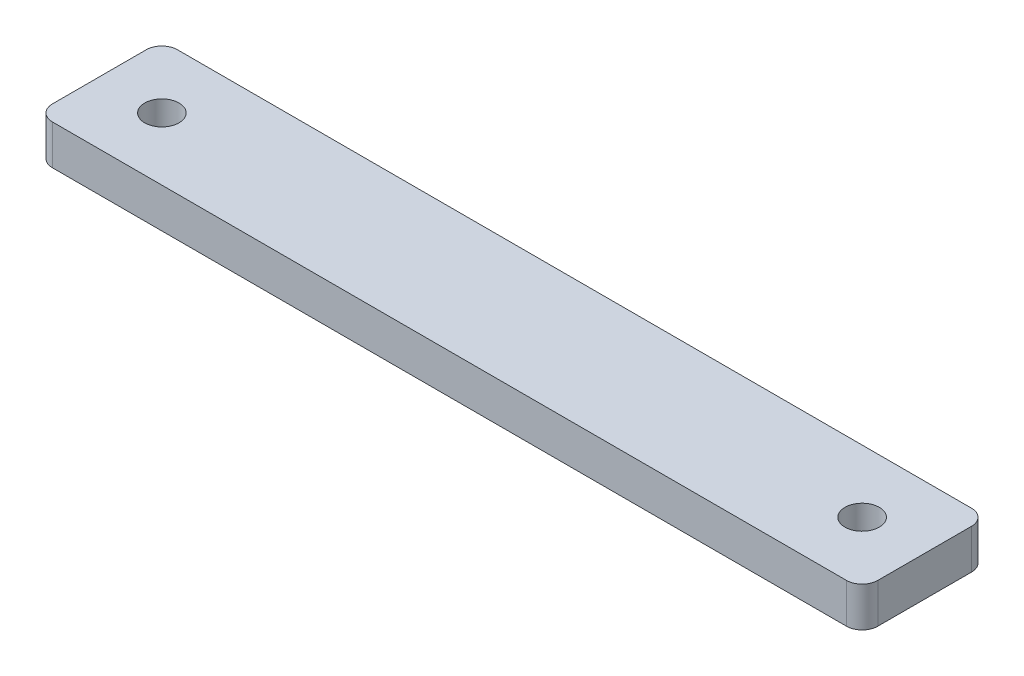
ISO-10303-21;
HEADER;
FILE_DESCRIPTION(('STEP AP214'),'2;1');
FILE_NAME('part.step','',(''),(''),'','','');
FILE_SCHEMA(('AUTOMOTIVE_DESIGN { 1 0 10303 214 1 1 1 1 }'));
ENDSEC;
DATA;
#1=APPLICATION_CONTEXT('core data for automotive mechanical design processes');
#2=APPLICATION_PROTOCOL_DEFINITION('international standard','automotive_design',2000,#1);
#3=PRODUCT_CONTEXT('',#1,'mechanical');
#4=PRODUCT('Part','Part','',(#3));
#5=PRODUCT_RELATED_PRODUCT_CATEGORY('part','',(#4));
#6=PRODUCT_DEFINITION_FORMATION('','',#4);
#7=PRODUCT_DEFINITION_CONTEXT('part definition',#1,'design');
#8=PRODUCT_DEFINITION('design','',#6,#7);
#9=PRODUCT_DEFINITION_SHAPE('','',#8);
#10=(LENGTH_UNIT() NAMED_UNIT(*) SI_UNIT(.MILLI.,.METRE.));
#11=(NAMED_UNIT(*) PLANE_ANGLE_UNIT() SI_UNIT($,.RADIAN.));
#12=(NAMED_UNIT(*) SI_UNIT($,.STERADIAN.) SOLID_ANGLE_UNIT());
#13=UNCERTAINTY_MEASURE_WITH_UNIT(LENGTH_MEASURE(1.E-05),#10,'distance_accuracy_value','');
#14=(GEOMETRIC_REPRESENTATION_CONTEXT(3) GLOBAL_UNCERTAINTY_ASSIGNED_CONTEXT((#13)) GLOBAL_UNIT_ASSIGNED_CONTEXT((#10,
#11,#12)) REPRESENTATION_CONTEXT('',''));
#15=CARTESIAN_POINT('',(0.,0.,0.));
#16=DIRECTION('',(0.,0.,1.));
#17=DIRECTION('',(1.,0.,0.));
#18=AXIS2_PLACEMENT_3D('',#15,#16,#17);
#19=CARTESIAN_POINT('',(0.,6.35,0.));
#20=DIRECTION('',(0.,1.,0.));
#21=DIRECTION('',(0.,0.,1.));
#22=AXIS2_PLACEMENT_3D('',#19,#20,#21);
#23=PLANE('',#22);
#24=CARTESIAN_POINT('',(-56.,6.35,0.));
#25=DIRECTION('',(0.,1.,0.));
#26=DIRECTION('',(0.,0.,1.));
#27=AXIS2_PLACEMENT_3D('',#24,#25,#26);
#28=CIRCLE('',#27,2.75);
#29=CARTESIAN_POINT('',(-56.,6.35,2.75));
#30=VERTEX_POINT('',#29);
#31=EDGE_CURVE('E192',#30,#30,#28,.T.);
#32=ORIENTED_EDGE('',*,*,#31,.F.);
#33=EDGE_LOOP('',(#32));
#34=FACE_BOUND('',#33,.T.);
#35=DIRECTION('',(0.,0.,-1.));
#36=VECTOR('',#35,1.);
#37=CARTESIAN_POINT('',(66.,6.35,9.99999999999999));
#38=LINE('',#37,#36);
#39=CARTESIAN_POINT('',(66.,6.35,7.49999999999999));
#40=VERTEX_POINT('',#39);
#41=CARTESIAN_POINT('',(66.,6.35,-7.50000000000001));
#42=VERTEX_POINT('',#41);
#43=EDGE_CURVE('E202',#40,#42,#38,.T.);
#44=ORIENTED_EDGE('',*,*,#43,.T.);
#45=CARTESIAN_POINT('',(63.5,6.35,-7.50000000000001));
#46=DIRECTION('',(0.,1.,0.));
#47=DIRECTION('',(0.,0.,1.));
#48=AXIS2_PLACEMENT_3D('',#45,#46,#47);
#49=CIRCLE('',#48,2.5);
#50=CARTESIAN_POINT('',(63.5,6.35,-10.));
#51=VERTEX_POINT('',#50);
#52=EDGE_CURVE('E171',#42,#51,#49,.T.);
#53=ORIENTED_EDGE('',*,*,#52,.T.);
#54=DIRECTION('',(-1.,0.,0.));
#55=VECTOR('',#54,1.);
#56=CARTESIAN_POINT('',(66.,6.35,-10.));
#57=LINE('',#56,#55);
#58=CARTESIAN_POINT('',(-63.5,6.35,-9.99999999999999));
#59=VERTEX_POINT('',#58);
#60=EDGE_CURVE('E129',#51,#59,#57,.T.);
#61=ORIENTED_EDGE('',*,*,#60,.T.);
#62=CARTESIAN_POINT('',(-63.5,6.35,-7.5));
#63=DIRECTION('',(0.,1.,0.));
#64=DIRECTION('',(0.,0.,1.));
#65=AXIS2_PLACEMENT_3D('',#62,#63,#64);
#66=CIRCLE('',#65,2.5);
#67=CARTESIAN_POINT('',(-66.,6.35,-7.5));
#68=VERTEX_POINT('',#67);
#69=EDGE_CURVE('E163',#59,#68,#66,.T.);
#70=ORIENTED_EDGE('',*,*,#69,.T.);
#71=DIRECTION('',(0.,0.,1.));
#72=VECTOR('',#71,1.);
#73=CARTESIAN_POINT('',(-66.,6.35,10.));
#74=LINE('',#73,#72);
#75=CARTESIAN_POINT('',(-66.,6.35,7.50000000000001));
#76=VERTEX_POINT('',#75);
#77=EDGE_CURVE('E138',#68,#76,#74,.T.);
#78=ORIENTED_EDGE('',*,*,#77,.T.);
#79=CARTESIAN_POINT('',(-63.5,6.35,7.50000000000001));
#80=DIRECTION('',(0.,1.,0.));
#81=DIRECTION('',(0.,0.,1.));
#82=AXIS2_PLACEMENT_3D('',#79,#80,#81);
#83=CIRCLE('',#82,2.5);
#84=CARTESIAN_POINT('',(-63.5,6.35,10.));
#85=VERTEX_POINT('',#84);
#86=EDGE_CURVE('E64',#76,#85,#83,.T.);
#87=ORIENTED_EDGE('',*,*,#86,.T.);
#88=DIRECTION('',(1.,0.,0.));
#89=VECTOR('',#88,1.);
#90=CARTESIAN_POINT('',(66.,6.35,9.99999999999999));
#91=LINE('',#90,#89);
#92=CARTESIAN_POINT('',(63.5,6.35,9.99999999999999));
#93=VERTEX_POINT('',#92);
#94=EDGE_CURVE('E143',#85,#93,#91,.T.);
#95=ORIENTED_EDGE('',*,*,#94,.T.);
#96=CARTESIAN_POINT('',(63.5,6.35,7.49999999999999));
#97=DIRECTION('',(0.,1.,0.));
#98=DIRECTION('',(0.,0.,1.));
#99=AXIS2_PLACEMENT_3D('',#96,#97,#98);
#100=CIRCLE('',#99,2.5);
#101=EDGE_CURVE('E168',#93,#40,#100,.T.);
#102=ORIENTED_EDGE('',*,*,#101,.T.);
#103=EDGE_LOOP('',(#44,#53,#61,#70,#78,#87,#95,#102));
#104=FACE_BOUND('',#103,.T.);
#105=CARTESIAN_POINT('',(56.,6.35,0.));
#106=DIRECTION('',(0.,1.,0.));
#107=DIRECTION('',(0.,0.,1.));
#108=AXIS2_PLACEMENT_3D('',#105,#106,#107);
#109=CIRCLE('',#108,2.75);
#110=CARTESIAN_POINT('',(56.,6.35,2.75));
#111=VERTEX_POINT('',#110);
#112=EDGE_CURVE('E210',#111,#111,#109,.T.);
#113=ORIENTED_EDGE('',*,*,#112,.F.);
#114=EDGE_LOOP('',(#113));
#115=FACE_BOUND('',#114,.T.);
#116=ADVANCED_FACE('F41',(#34,#104,#115),#23,.T.);
#117=CARTESIAN_POINT('',(0.,0.,0.));
#118=DIRECTION('',(0.,1.,0.));
#119=DIRECTION('',(0.,0.,1.));
#120=AXIS2_PLACEMENT_3D('',#117,#118,#119);
#121=PLANE('',#120);
#122=DIRECTION('',(-1.,0.,0.));
#123=VECTOR('',#122,1.);
#124=CARTESIAN_POINT('',(66.,0.,-10.));
#125=LINE('',#124,#123);
#126=CARTESIAN_POINT('',(63.5,0.,-10.));
#127=VERTEX_POINT('',#126);
#128=CARTESIAN_POINT('',(-63.5,0.,-9.99999999999999));
#129=VERTEX_POINT('',#128);
#130=EDGE_CURVE('E126',#127,#129,#125,.T.);
#131=ORIENTED_EDGE('',*,*,#130,.F.);
#132=CARTESIAN_POINT('',(63.5,0.,-7.50000000000001));
#133=DIRECTION('',(0.,1.,0.));
#134=DIRECTION('',(0.,0.,1.));
#135=AXIS2_PLACEMENT_3D('',#132,#133,#134);
#136=CIRCLE('',#135,2.5);
#137=CARTESIAN_POINT('',(66.,0.,-7.50000000000001));
#138=VERTEX_POINT('',#137);
#139=EDGE_CURVE('E108',#127,#138,#136,.F.);
#140=ORIENTED_EDGE('',*,*,#139,.T.);
#141=DIRECTION('',(0.,0.,-1.));
#142=VECTOR('',#141,1.);
#143=CARTESIAN_POINT('',(66.,0.,9.99999999999999));
#144=LINE('',#143,#142);
#145=CARTESIAN_POINT('',(66.,0.,7.49999999999999));
#146=VERTEX_POINT('',#145);
#147=EDGE_CURVE('E139',#146,#138,#144,.T.);
#148=ORIENTED_EDGE('',*,*,#147,.F.);
#149=CARTESIAN_POINT('',(63.5,0.,7.49999999999999));
#150=DIRECTION('',(0.,1.,0.));
#151=DIRECTION('',(0.,0.,1.));
#152=AXIS2_PLACEMENT_3D('',#149,#150,#151);
#153=CIRCLE('',#152,2.5);
#154=CARTESIAN_POINT('',(63.5,0.,9.99999999999999));
#155=VERTEX_POINT('',#154);
#156=EDGE_CURVE('E120',#146,#155,#153,.F.);
#157=ORIENTED_EDGE('',*,*,#156,.T.);
#158=DIRECTION('',(1.,0.,0.));
#159=VECTOR('',#158,1.);
#160=CARTESIAN_POINT('',(66.,0.,9.99999999999999));
#161=LINE('',#160,#159);
#162=CARTESIAN_POINT('',(-63.5,0.,10.));
#163=VERTEX_POINT('',#162);
#164=EDGE_CURVE('E145',#163,#155,#161,.T.);
#165=ORIENTED_EDGE('',*,*,#164,.F.);
#166=CARTESIAN_POINT('',(-63.5,0.,7.50000000000001));
#167=DIRECTION('',(0.,1.,0.));
#168=DIRECTION('',(0.,0.,1.));
#169=AXIS2_PLACEMENT_3D('',#166,#167,#168);
#170=CIRCLE('',#169,2.5);
#171=CARTESIAN_POINT('',(-66.,0.,7.50000000000001));
#172=VERTEX_POINT('',#171);
#173=EDGE_CURVE('E153',#163,#172,#170,.F.);
#174=ORIENTED_EDGE('',*,*,#173,.T.);
#175=DIRECTION('',(0.,0.,1.));
#176=VECTOR('',#175,1.);
#177=CARTESIAN_POINT('',(-66.,0.,10.));
#178=LINE('',#177,#176);
#179=CARTESIAN_POINT('',(-66.,0.,-7.5));
#180=VERTEX_POINT('',#179);
#181=EDGE_CURVE('E186',#180,#172,#178,.T.);
#182=ORIENTED_EDGE('',*,*,#181,.F.);
#183=CARTESIAN_POINT('',(-63.5,0.,-7.5));
#184=DIRECTION('',(0.,1.,0.));
#185=DIRECTION('',(0.,0.,1.));
#186=AXIS2_PLACEMENT_3D('',#183,#184,#185);
#187=CIRCLE('',#186,2.5);
#188=EDGE_CURVE('E131',#180,#129,#187,.F.);
#189=ORIENTED_EDGE('',*,*,#188,.T.);
#190=EDGE_LOOP('',(#131,#140,#148,#157,#165,#174,#182,#189));
#191=FACE_BOUND('',#190,.T.);
#192=CARTESIAN_POINT('',(-56.,0.,0.));
#193=DIRECTION('',(0.,1.,0.));
#194=DIRECTION('',(0.,0.,1.));
#195=AXIS2_PLACEMENT_3D('',#192,#193,#194);
#196=CIRCLE('',#195,2.75);
#197=CARTESIAN_POINT('',(-56.,0.,2.75));
#198=VERTEX_POINT('',#197);
#199=EDGE_CURVE('E197',#198,#198,#196,.T.);
#200=ORIENTED_EDGE('',*,*,#199,.T.);
#201=EDGE_LOOP('',(#200));
#202=FACE_BOUND('',#201,.T.);
#203=CARTESIAN_POINT('',(56.,0.,0.));
#204=DIRECTION('',(0.,1.,0.));
#205=DIRECTION('',(0.,0.,1.));
#206=AXIS2_PLACEMENT_3D('',#203,#204,#205);
#207=CIRCLE('',#206,2.75);
#208=CARTESIAN_POINT('',(56.,0.,2.75));
#209=VERTEX_POINT('',#208);
#210=EDGE_CURVE('E212',#209,#209,#207,.T.);
#211=ORIENTED_EDGE('',*,*,#210,.T.);
#212=EDGE_LOOP('',(#211));
#213=FACE_BOUND('',#212,.T.);
#214=ADVANCED_FACE('F134',(#191,#202,#213),#121,.F.);
#215=CARTESIAN_POINT('',(-66.,6.35,10.));
#216=DIRECTION('',(1.,0.,0.));
#217=DIRECTION('',(0.,0.,-1.));
#218=AXIS2_PLACEMENT_3D('',#215,#216,#217);
#219=PLANE('',#218);
#220=ORIENTED_EDGE('',*,*,#181,.T.);
#221=DIRECTION('',(0.,-1.,0.));
#222=VECTOR('',#221,1.);
#223=CARTESIAN_POINT('',(-66.,6.35,7.50000000000001));
#224=LINE('',#223,#222);
#225=EDGE_CURVE('E11',#172,#76,#224,.F.);
#226=ORIENTED_EDGE('',*,*,#225,.T.);
#227=ORIENTED_EDGE('',*,*,#77,.F.);
#228=DIRECTION('',(0.,-1.,0.));
#229=VECTOR('',#228,1.);
#230=CARTESIAN_POINT('',(-66.,6.35,-7.5));
#231=LINE('',#230,#229);
#232=EDGE_CURVE('E50',#68,#180,#231,.T.);
#233=ORIENTED_EDGE('',*,*,#232,.T.);
#234=EDGE_LOOP('',(#220,#226,#227,#233));
#235=FACE_BOUND('',#234,.T.);
#236=ADVANCED_FACE('F185',(#235),#219,.F.);
#237=CARTESIAN_POINT('',(66.,6.35,9.99999999999999));
#238=DIRECTION('',(0.,0.,-1.));
#239=DIRECTION('',(-1.,0.,0.));
#240=AXIS2_PLACEMENT_3D('',#237,#238,#239);
#241=PLANE('',#240);
#242=ORIENTED_EDGE('',*,*,#164,.T.);
#243=DIRECTION('',(0.,-1.,0.));
#244=VECTOR('',#243,1.);
#245=CARTESIAN_POINT('',(63.5,6.35,9.99999999999999));
#246=LINE('',#245,#244);
#247=EDGE_CURVE('E57',#155,#93,#246,.F.);
#248=ORIENTED_EDGE('',*,*,#247,.T.);
#249=ORIENTED_EDGE('',*,*,#94,.F.);
#250=DIRECTION('',(0.,-1.,0.));
#251=VECTOR('',#250,1.);
#252=CARTESIAN_POINT('',(-63.5,6.35,10.));
#253=LINE('',#252,#251);
#254=EDGE_CURVE('E174',#85,#163,#253,.T.);
#255=ORIENTED_EDGE('',*,*,#254,.T.);
#256=EDGE_LOOP('',(#242,#248,#249,#255));
#257=FACE_BOUND('',#256,.T.);
#258=ADVANCED_FACE('F240',(#257),#241,.F.);
#259=CARTESIAN_POINT('',(66.,6.35,9.99999999999999));
#260=DIRECTION('',(-1.,0.,0.));
#261=DIRECTION('',(0.,0.,1.));
#262=AXIS2_PLACEMENT_3D('',#259,#260,#261);
#263=PLANE('',#262);
#264=ORIENTED_EDGE('',*,*,#147,.T.);
#265=DIRECTION('',(0.,-1.,0.));
#266=VECTOR('',#265,1.);
#267=CARTESIAN_POINT('',(66.,6.35,-7.50000000000001));
#268=LINE('',#267,#266);
#269=EDGE_CURVE('E113',#138,#42,#268,.F.);
#270=ORIENTED_EDGE('',*,*,#269,.T.);
#271=ORIENTED_EDGE('',*,*,#43,.F.);
#272=DIRECTION('',(0.,-1.,0.));
#273=VECTOR('',#272,1.);
#274=CARTESIAN_POINT('',(66.,6.35,7.49999999999999));
#275=LINE('',#274,#273);
#276=EDGE_CURVE('E119',#40,#146,#275,.T.);
#277=ORIENTED_EDGE('',*,*,#276,.T.);
#278=EDGE_LOOP('',(#264,#270,#271,#277));
#279=FACE_BOUND('',#278,.T.);
#280=ADVANCED_FACE('F237',(#279),#263,.F.);
#281=CARTESIAN_POINT('',(66.,6.35,-10.));
#282=DIRECTION('',(0.,0.,1.));
#283=DIRECTION('',(1.,0.,0.));
#284=AXIS2_PLACEMENT_3D('',#281,#282,#283);
#285=PLANE('',#284);
#286=ORIENTED_EDGE('',*,*,#60,.F.);
#287=DIRECTION('',(0.,-1.,0.));
#288=VECTOR('',#287,1.);
#289=CARTESIAN_POINT('',(63.5,6.35,-10.));
#290=LINE('',#289,#288);
#291=EDGE_CURVE('E112',#51,#127,#290,.T.);
#292=ORIENTED_EDGE('',*,*,#291,.T.);
#293=ORIENTED_EDGE('',*,*,#130,.T.);
#294=DIRECTION('',(0.,-1.,0.));
#295=VECTOR('',#294,1.);
#296=CARTESIAN_POINT('',(-63.5,6.35,-9.99999999999999));
#297=LINE('',#296,#295);
#298=EDGE_CURVE('E132',#129,#59,#297,.F.);
#299=ORIENTED_EDGE('',*,*,#298,.T.);
#300=EDGE_LOOP('',(#286,#292,#293,#299));
#301=FACE_BOUND('',#300,.T.);
#302=ADVANCED_FACE('F125',(#301),#285,.F.);
#303=CARTESIAN_POINT('',(-56.,6.35,0.));
#304=DIRECTION('',(0.,-1.,0.));
#305=DIRECTION('',(0.,0.,-1.));
#306=AXIS2_PLACEMENT_3D('',#303,#304,#305);
#307=CYLINDRICAL_SURFACE('',#306,2.75);
#308=ORIENTED_EDGE('',*,*,#31,.T.);
#309=EDGE_LOOP('',(#308));
#310=FACE_BOUND('',#309,.T.);
#311=ORIENTED_EDGE('',*,*,#199,.F.);
#312=EDGE_LOOP('',(#311));
#313=FACE_BOUND('',#312,.T.);
#314=ADVANCED_FACE('F232',(#310,#313),#307,.F.);
#315=CARTESIAN_POINT('',(56.,6.35,0.));
#316=DIRECTION('',(0.,-1.,0.));
#317=DIRECTION('',(0.,0.,-1.));
#318=AXIS2_PLACEMENT_3D('',#315,#316,#317);
#319=CYLINDRICAL_SURFACE('',#318,2.75);
#320=ORIENTED_EDGE('',*,*,#112,.T.);
#321=EDGE_LOOP('',(#320));
#322=FACE_BOUND('',#321,.T.);
#323=ORIENTED_EDGE('',*,*,#210,.F.);
#324=EDGE_LOOP('',(#323));
#325=FACE_BOUND('',#324,.T.);
#326=ADVANCED_FACE('F220',(#322,#325),#319,.F.);
#327=CARTESIAN_POINT('',(63.5,6.35,-7.50000000000001));
#328=DIRECTION('',(0.,-1.,0.));
#329=DIRECTION('',(0.,0.,-1.));
#330=AXIS2_PLACEMENT_3D('',#327,#328,#329);
#331=CYLINDRICAL_SURFACE('',#330,2.5);
#332=ORIENTED_EDGE('',*,*,#52,.F.);
#333=ORIENTED_EDGE('',*,*,#269,.F.);
#334=ORIENTED_EDGE('',*,*,#139,.F.);
#335=ORIENTED_EDGE('',*,*,#291,.F.);
#336=EDGE_LOOP('',(#332,#333,#334,#335));
#337=FACE_BOUND('',#336,.T.);
#338=ADVANCED_FACE('F111',(#337),#331,.T.);
#339=CARTESIAN_POINT('',(63.5,6.35,7.49999999999999));
#340=DIRECTION('',(0.,-1.,0.));
#341=DIRECTION('',(0.,0.,-1.));
#342=AXIS2_PLACEMENT_3D('',#339,#340,#341);
#343=CYLINDRICAL_SURFACE('',#342,2.5);
#344=ORIENTED_EDGE('',*,*,#101,.F.);
#345=ORIENTED_EDGE('',*,*,#247,.F.);
#346=ORIENTED_EDGE('',*,*,#156,.F.);
#347=ORIENTED_EDGE('',*,*,#276,.F.);
#348=EDGE_LOOP('',(#344,#345,#346,#347));
#349=FACE_BOUND('',#348,.T.);
#350=ADVANCED_FACE('F248',(#349),#343,.T.);
#351=CARTESIAN_POINT('',(-63.5,6.35,7.50000000000001));
#352=DIRECTION('',(0.,-1.,0.));
#353=DIRECTION('',(0.,0.,-1.));
#354=AXIS2_PLACEMENT_3D('',#351,#352,#353);
#355=CYLINDRICAL_SURFACE('',#354,2.5);
#356=ORIENTED_EDGE('',*,*,#86,.F.);
#357=ORIENTED_EDGE('',*,*,#225,.F.);
#358=ORIENTED_EDGE('',*,*,#173,.F.);
#359=ORIENTED_EDGE('',*,*,#254,.F.);
#360=EDGE_LOOP('',(#356,#357,#358,#359));
#361=FACE_BOUND('',#360,.T.);
#362=ADVANCED_FACE('F250',(#361),#355,.T.);
#363=CARTESIAN_POINT('',(-63.5,6.35,-7.5));
#364=DIRECTION('',(0.,-1.,0.));
#365=DIRECTION('',(0.,0.,-1.));
#366=AXIS2_PLACEMENT_3D('',#363,#364,#365);
#367=CYLINDRICAL_SURFACE('',#366,2.5);
#368=ORIENTED_EDGE('',*,*,#69,.F.);
#369=ORIENTED_EDGE('',*,*,#298,.F.);
#370=ORIENTED_EDGE('',*,*,#188,.F.);
#371=ORIENTED_EDGE('',*,*,#232,.F.);
#372=EDGE_LOOP('',(#368,#369,#370,#371));
#373=FACE_BOUND('',#372,.T.);
#374=ADVANCED_FACE('F43',(#373),#367,.T.);
#375=CLOSED_SHELL('',(#116,#214,#236,#258,#280,#302,#314,#326,#338,#350,#362,#374));
#376=MANIFOLD_SOLID_BREP('B2',#375);
#377=ADVANCED_BREP_SHAPE_REPRESENTATION('',(#18,#376),#14);
#378=SHAPE_DEFINITION_REPRESENTATION(#9,#377);
ENDSEC;
END-ISO-10303-21;
